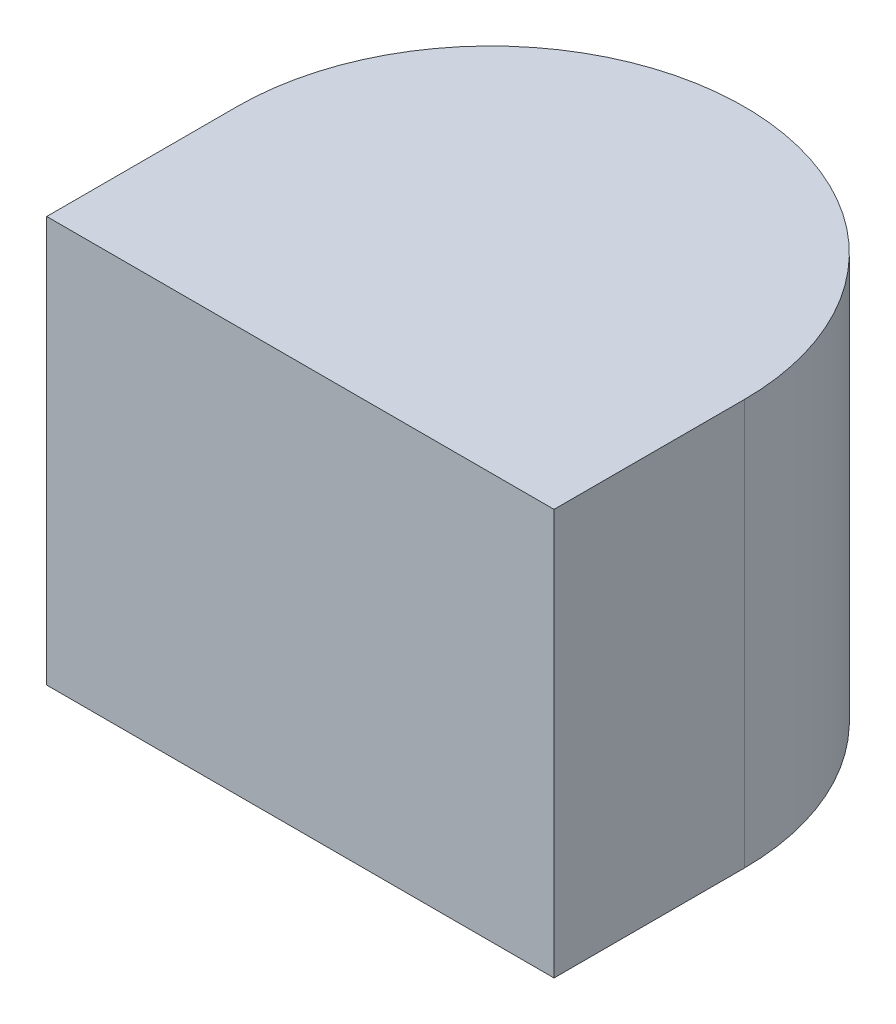
ISO-10303-21;
HEADER;
FILE_DESCRIPTION(('STEP AP214'),'2;1');
FILE_NAME('part.step','',(''),(''),'','','');
FILE_SCHEMA(('AUTOMOTIVE_DESIGN { 1 0 10303 214 1 1 1 1 }'));
ENDSEC;
DATA;
#1=APPLICATION_CONTEXT('core data for automotive mechanical design processes');
#2=APPLICATION_PROTOCOL_DEFINITION('international standard','automotive_design',2000,#1);
#3=PRODUCT_CONTEXT('',#1,'mechanical');
#4=PRODUCT('Part','Part','',(#3));
#5=PRODUCT_RELATED_PRODUCT_CATEGORY('part','',(#4));
#6=PRODUCT_DEFINITION_FORMATION('','',#4);
#7=PRODUCT_DEFINITION_CONTEXT('part definition',#1,'design');
#8=PRODUCT_DEFINITION('design','',#6,#7);
#9=PRODUCT_DEFINITION_SHAPE('','',#8);
#10=(LENGTH_UNIT() NAMED_UNIT(*) SI_UNIT(.MILLI.,.METRE.));
#11=(NAMED_UNIT(*) PLANE_ANGLE_UNIT() SI_UNIT($,.RADIAN.));
#12=(NAMED_UNIT(*) SI_UNIT($,.STERADIAN.) SOLID_ANGLE_UNIT());
#13=UNCERTAINTY_MEASURE_WITH_UNIT(LENGTH_MEASURE(1.E-05),#10,'distance_accuracy_value','');
#14=(GEOMETRIC_REPRESENTATION_CONTEXT(3) GLOBAL_UNCERTAINTY_ASSIGNED_CONTEXT((#13)) GLOBAL_UNIT_ASSIGNED_CONTEXT((#10,
#11,#12)) REPRESENTATION_CONTEXT('',''));
#15=CARTESIAN_POINT('',(0.,0.,0.));
#16=DIRECTION('',(0.,0.,1.));
#17=DIRECTION('',(1.,0.,0.));
#18=AXIS2_PLACEMENT_3D('',#15,#16,#17);
#19=CARTESIAN_POINT('',(-1.27,3.468427124746,4.78));
#20=DIRECTION('',(0.,-1.,0.));
#21=DIRECTION('',(0.,0.,-1.));
#22=AXIS2_PLACEMENT_3D('',#19,#20,#21);
#23=CYLINDRICAL_SURFACE('',#22,0.4);
#24=CARTESIAN_POINT('',(-1.27,0.,4.78));
#25=DIRECTION('',(0.,-1.,0.));
#26=DIRECTION('',(0.,0.,-1.));
#27=AXIS2_PLACEMENT_3D('',#24,#25,#26);
#28=CIRCLE('',#27,0.4);
#29=CARTESIAN_POINT('',(-0.87,0.,4.78));
#30=VERTEX_POINT('',#29);
#31=CARTESIAN_POINT('',(-1.67,0.,4.78));
#32=VERTEX_POINT('',#31);
#33=EDGE_CURVE('E20',#30,#32,#28,.F.);
#34=ORIENTED_EDGE('',*,*,#33,.T.);
#35=DIRECTION('',(0.,1.,0.));
#36=VECTOR('',#35,1.);
#37=CARTESIAN_POINT('',(-1.67,3.468427124746,4.78));
#38=LINE('',#37,#36);
#39=CARTESIAN_POINT('',(-1.67,0.64,4.78));
#40=VERTEX_POINT('',#39);
#41=EDGE_CURVE('E58',#32,#40,#38,.T.);
#42=ORIENTED_EDGE('',*,*,#41,.T.);
#43=CARTESIAN_POINT('',(-1.27,0.64,4.78));
#44=DIRECTION('',(0.,-1.,0.));
#45=DIRECTION('',(0.,0.,-1.));
#46=AXIS2_PLACEMENT_3D('',#43,#44,#45);
#47=CIRCLE('',#46,0.4);
#48=CARTESIAN_POINT('',(-0.87,0.64,4.78));
#49=VERTEX_POINT('',#48);
#50=EDGE_CURVE('E84',#49,#40,#47,.F.);
#51=ORIENTED_EDGE('',*,*,#50,.F.);
#52=DIRECTION('',(0.,1.,0.));
#53=VECTOR('',#52,1.);
#54=CARTESIAN_POINT('',(-0.87,3.468427124746,4.78));
#55=LINE('',#54,#53);
#56=EDGE_CURVE('E54',#49,#30,#55,.F.);
#57=ORIENTED_EDGE('',*,*,#56,.T.);
#58=EDGE_LOOP('',(#34,#42,#51,#57));
#59=FACE_BOUND('',#58,.T.);
#60=ADVANCED_FACE('F17',(#59),#23,.T.);
#61=CARTESIAN_POINT('',(-0.87,3.468427124746,4.78));
#62=DIRECTION('',(-1.,0.,0.));
#63=DIRECTION('',(0.,0.,1.));
#64=AXIS2_PLACEMENT_3D('',#61,#62,#63);
#65=PLANE('',#64);
#66=DIRECTION('',(0.,1.,0.));
#67=VECTOR('',#66,1.);
#68=CARTESIAN_POINT('',(-0.87,3.468427124746,5.08));
#69=LINE('',#68,#67);
#70=CARTESIAN_POINT('',(-0.87,0.64,5.08));
#71=VERTEX_POINT('',#70);
#72=CARTESIAN_POINT('',(-0.87,0.,5.08));
#73=VERTEX_POINT('',#72);
#74=EDGE_CURVE('E82',#71,#73,#69,.F.);
#75=ORIENTED_EDGE('',*,*,#74,.T.);
#76=DIRECTION('',(0.,0.,1.));
#77=VECTOR('',#76,1.);
#78=CARTESIAN_POINT('',(-0.87,0.,4.78));
#79=LINE('',#78,#77);
#80=EDGE_CURVE('E63',#73,#30,#79,.F.);
#81=ORIENTED_EDGE('',*,*,#80,.T.);
#82=ORIENTED_EDGE('',*,*,#56,.F.);
#83=DIRECTION('',(0.,0.,1.));
#84=VECTOR('',#83,1.);
#85=CARTESIAN_POINT('',(-0.87,0.64,0.));
#86=LINE('',#85,#84);
#87=EDGE_CURVE('E68',#71,#49,#86,.F.);
#88=ORIENTED_EDGE('',*,*,#87,.F.);
#89=EDGE_LOOP('',(#75,#81,#82,#88));
#90=FACE_BOUND('',#89,.T.);
#91=ADVANCED_FACE('F104',(#90),#65,.F.);
#92=CARTESIAN_POINT('',(-1.27,0.,4.78));
#93=DIRECTION('',(0.,1.,0.));
#94=DIRECTION('',(0.,0.,1.));
#95=AXIS2_PLACEMENT_3D('',#92,#93,#94);
#96=PLANE('',#95);
#97=ORIENTED_EDGE('',*,*,#80,.F.);
#98=DIRECTION('',(-1.,0.,0.));
#99=VECTOR('',#98,1.);
#100=CARTESIAN_POINT('',(-1.67,0.,5.08));
#101=LINE('',#100,#99);
#102=CARTESIAN_POINT('',(-1.67,0.,5.08));
#103=VERTEX_POINT('',#102);
#104=EDGE_CURVE('E73',#73,#103,#101,.T.);
#105=ORIENTED_EDGE('',*,*,#104,.T.);
#106=DIRECTION('',(0.,0.,-1.));
#107=VECTOR('',#106,1.);
#108=CARTESIAN_POINT('',(-1.67,0.,4.78));
#109=LINE('',#108,#107);
#110=EDGE_CURVE('E62',#103,#32,#109,.T.);
#111=ORIENTED_EDGE('',*,*,#110,.T.);
#112=ORIENTED_EDGE('',*,*,#33,.F.);
#113=EDGE_LOOP('',(#97,#105,#111,#112));
#114=FACE_BOUND('',#113,.T.);
#115=ADVANCED_FACE('F71',(#114),#96,.F.);
#116=CARTESIAN_POINT('',(-1.67,3.468427124746,4.78));
#117=DIRECTION('',(1.,0.,0.));
#118=DIRECTION('',(0.,0.,-1.));
#119=AXIS2_PLACEMENT_3D('',#116,#117,#118);
#120=PLANE('',#119);
#121=ORIENTED_EDGE('',*,*,#41,.F.);
#122=ORIENTED_EDGE('',*,*,#110,.F.);
#123=DIRECTION('',(0.,1.,0.));
#124=VECTOR('',#123,1.);
#125=CARTESIAN_POINT('',(-1.67,3.468427124746,5.08));
#126=LINE('',#125,#124);
#127=CARTESIAN_POINT('',(-1.67,0.64,5.08));
#128=VERTEX_POINT('',#127);
#129=EDGE_CURVE('E26',#103,#128,#126,.T.);
#130=ORIENTED_EDGE('',*,*,#129,.T.);
#131=DIRECTION('',(0.,0.,1.));
#132=VECTOR('',#131,1.);
#133=CARTESIAN_POINT('',(-1.67,0.64,0.));
#134=LINE('',#133,#132);
#135=EDGE_CURVE('E34',#40,#128,#134,.T.);
#136=ORIENTED_EDGE('',*,*,#135,.F.);
#137=EDGE_LOOP('',(#121,#122,#130,#136));
#138=FACE_BOUND('',#137,.T.);
#139=ADVANCED_FACE('F65',(#138),#120,.F.);
#140=CARTESIAN_POINT('',(0.,0.64,0.));
#141=DIRECTION('',(0.,1.,0.));
#142=DIRECTION('',(0.,0.,1.));
#143=AXIS2_PLACEMENT_3D('',#140,#141,#142);
#144=PLANE('',#143);
#145=ORIENTED_EDGE('',*,*,#135,.T.);
#146=DIRECTION('',(-1.,0.,0.));
#147=VECTOR('',#146,1.);
#148=CARTESIAN_POINT('',(-1.67,0.64,5.08));
#149=LINE('',#148,#147);
#150=EDGE_CURVE('E11',#128,#71,#149,.F.);
#151=ORIENTED_EDGE('',*,*,#150,.T.);
#152=ORIENTED_EDGE('',*,*,#87,.T.);
#153=ORIENTED_EDGE('',*,*,#50,.T.);
#154=EDGE_LOOP('',(#145,#151,#152,#153));
#155=FACE_BOUND('',#154,.T.);
#156=ADVANCED_FACE('F107',(#155),#144,.T.);
#157=CARTESIAN_POINT('',(-1.67,3.468427124746,5.08));
#158=DIRECTION('',(0.,0.,-1.));
#159=DIRECTION('',(-1.,0.,0.));
#160=AXIS2_PLACEMENT_3D('',#157,#158,#159);
#161=PLANE('',#160);
#162=ORIENTED_EDGE('',*,*,#129,.F.);
#163=ORIENTED_EDGE('',*,*,#104,.F.);
#164=ORIENTED_EDGE('',*,*,#74,.F.);
#165=ORIENTED_EDGE('',*,*,#150,.F.);
#166=EDGE_LOOP('',(#162,#163,#164,#165));
#167=FACE_BOUND('',#166,.T.);
#168=ADVANCED_FACE('F106',(#167),#161,.F.);
#169=CLOSED_SHELL('',(#60,#91,#115,#139,#156,#168));
#170=MANIFOLD_SOLID_BREP('B1',#169);
#171=ADVANCED_BREP_SHAPE_REPRESENTATION('',(#18,#170),#14);
#172=SHAPE_DEFINITION_REPRESENTATION(#9,#171);
ENDSEC;
END-ISO-10303-21;
